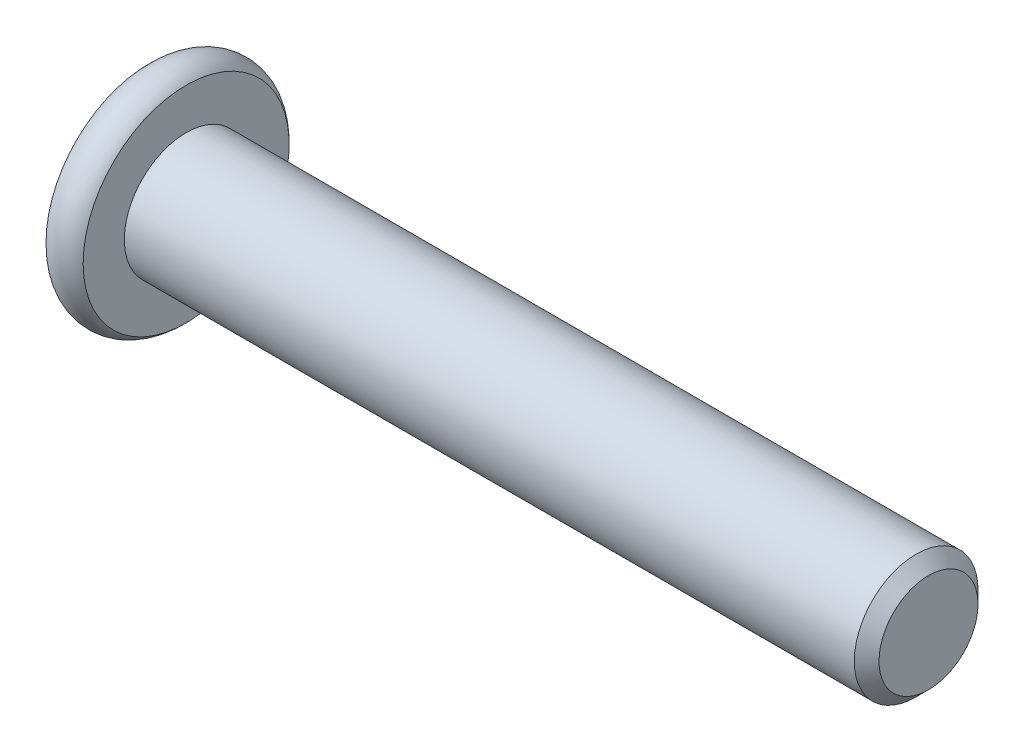
ISO-10303-21;
HEADER;
FILE_DESCRIPTION(('STEP AP214'),'2;1');
FILE_NAME('part.step','',(''),(''),'','','');
FILE_SCHEMA(('AUTOMOTIVE_DESIGN { 1 0 10303 214 1 1 1 1 }'));
ENDSEC;
DATA;
#1=APPLICATION_CONTEXT('core data for automotive mechanical design processes');
#2=APPLICATION_PROTOCOL_DEFINITION('international standard','automotive_design',2000,#1);
#3=PRODUCT_CONTEXT('',#1,'mechanical');
#4=PRODUCT('Part','Part','',(#3));
#5=PRODUCT_RELATED_PRODUCT_CATEGORY('part','',(#4));
#6=PRODUCT_DEFINITION_FORMATION('','',#4);
#7=PRODUCT_DEFINITION_CONTEXT('part definition',#1,'design');
#8=PRODUCT_DEFINITION('design','',#6,#7);
#9=PRODUCT_DEFINITION_SHAPE('','',#8);
#10=(LENGTH_UNIT() NAMED_UNIT(*) SI_UNIT(.MILLI.,.METRE.));
#11=(NAMED_UNIT(*) PLANE_ANGLE_UNIT() SI_UNIT($,.RADIAN.));
#12=(NAMED_UNIT(*) SI_UNIT($,.STERADIAN.) SOLID_ANGLE_UNIT());
#13=UNCERTAINTY_MEASURE_WITH_UNIT(LENGTH_MEASURE(1.E-05),#10,'distance_accuracy_value','');
#14=(GEOMETRIC_REPRESENTATION_CONTEXT(3) GLOBAL_UNCERTAINTY_ASSIGNED_CONTEXT((#13)) GLOBAL_UNIT_ASSIGNED_CONTEXT((#10,
#11,#12)) REPRESENTATION_CONTEXT('',''));
#15=CARTESIAN_POINT('',(0.,0.,0.));
#16=DIRECTION('',(0.,0.,1.));
#17=DIRECTION('',(1.,0.,0.));
#18=AXIS2_PLACEMENT_3D('',#15,#16,#17);
#19=CARTESIAN_POINT('',(-29.2,4.9960036108132E-13,-1.66533453693773E-13));
#20=DIRECTION('',(-1.,0.,0.));
#21=DIRECTION('',(0.,-1.,0.));
#22=AXIS2_PLACEMENT_3D('',#19,#20,#21);
#23=PLANE('',#22);
#24=DIRECTION('',(0.,-0.5,-0.866025403784439));
#25=VECTOR('',#24,1.);
#26=CARTESIAN_POINT('',(-29.1999999999998,-1.73205080756833,-1.11022302462516E-13));
#27=LINE('',#26,#25);
#28=CARTESIAN_POINT('',(-29.1999999999998,-1.73205080756837,-1.36681350815989E-13));
#29=VERTEX_POINT('',#28);
#30=CARTESIAN_POINT('',(-29.1999999999999,-0.866025403783914,1.49999999999998));
#31=VERTEX_POINT('',#30);
#32=EDGE_CURVE('E104',#29,#31,#27,.F.);
#33=ORIENTED_EDGE('',*,*,#32,.T.);
#34=DIRECTION('',(0.,1.,0.));
#35=VECTOR('',#34,1.);
#36=CARTESIAN_POINT('',(-29.2,-0.866025403784165,1.5));
#37=LINE('',#36,#35);
#38=CARTESIAN_POINT('',(-29.2,0.866025403784831,1.50000000000004));
#39=VERTEX_POINT('',#38);
#40=EDGE_CURVE('E120',#31,#39,#37,.T.);
#41=ORIENTED_EDGE('',*,*,#40,.T.);
#42=DIRECTION('',(0.,-0.5,0.866025403784439));
#43=VECTOR('',#42,1.);
#44=CARTESIAN_POINT('',(-29.2,0.866025403784831,1.50000000000006));
#45=LINE('',#44,#43);
#46=CARTESIAN_POINT('',(-29.2,1.73205080756935,-1.2616671602424E-13));
#47=VERTEX_POINT('',#46);
#48=EDGE_CURVE('E72',#39,#47,#45,.F.);
#49=ORIENTED_EDGE('',*,*,#48,.T.);
#50=DIRECTION('',(0.,0.5,0.866025403784439));
#51=VECTOR('',#50,1.);
#52=CARTESIAN_POINT('',(-29.2,1.73205080756916,-2.77555756156289E-13));
#53=LINE('',#52,#51);
#54=CARTESIAN_POINT('',(-29.2,0.866025403784858,-1.50000000000003));
#55=VERTEX_POINT('',#54);
#56=EDGE_CURVE('E86',#47,#55,#53,.F.);
#57=ORIENTED_EDGE('',*,*,#56,.T.);
#58=DIRECTION('',(0.,1.,0.));
#59=VECTOR('',#58,1.);
#60=CARTESIAN_POINT('',(-29.1999999999999,0.866025403784776,-1.5));
#61=LINE('',#60,#59);
#62=CARTESIAN_POINT('',(-29.1999999999998,-0.866025403784165,-1.49999999999996));
#63=VERTEX_POINT('',#62);
#64=EDGE_CURVE('E88',#55,#63,#61,.F.);
#65=ORIENTED_EDGE('',*,*,#64,.T.);
#66=DIRECTION('',(0.,0.5,-0.866025403784439));
#67=VECTOR('',#66,1.);
#68=CARTESIAN_POINT('',(-29.1999999999998,-0.866025403784165,-1.49999999999995));
#69=LINE('',#68,#67);
#70=EDGE_CURVE('E97',#63,#29,#69,.F.);
#71=ORIENTED_EDGE('',*,*,#70,.T.);
#72=EDGE_LOOP('',(#33,#41,#49,#57,#65,#71));
#73=FACE_BOUND('',#72,.T.);
#74=ADVANCED_FACE('F16',(#73),#23,.T.);
#75=CARTESIAN_POINT('',(-29.1999999999999,0.866025403784776,-1.5));
#76=DIRECTION('',(0.,0.,-1.));
#77=DIRECTION('',(-1.,0.,0.));
#78=AXIS2_PLACEMENT_3D('',#75,#76,#77);
#79=PLANE('',#78);
#80=CARTESIAN_POINT('',(-31.4499999646141,0.866025333109033,-1.5000000000085));
#81=CARTESIAN_POINT('',(-31.4202628181005,0.806493905015061,-1.50000000000306));
#82=CARTESIAN_POINT('',(-31.3922724727218,0.745967110571508,-1.50000000000082));
#83=CARTESIAN_POINT('',(-31.341023345539,0.622546765553089,-1.49999999999918));
#84=CARTESIAN_POINT('',(-31.3177930694095,0.559641484114204,-1.49999999999978));
#85=CARTESIAN_POINT('',(-31.2779994504319,0.432796069089136,-1.50000000000022));
#86=CARTESIAN_POINT('',(-31.2613361148305,0.368888221793658,-1.50000000000006));
#87=CARTESIAN_POINT('',(-31.2356630720953,0.239665989410866,-1.49999999999995));
#88=CARTESIAN_POINT('',(-31.2266342081959,0.174355549031414,-1.49999999999999));
#89=CARTESIAN_POINT('',(-31.2184874101039,0.0617869427984574,-1.50000000000001));
#90=CARTESIAN_POINT('',(-31.2172818822941,0.0146740817531845,-1.50000000000001));
#91=CARTESIAN_POINT('',(-31.2193161387584,-0.079468418716285,-1.5));
#92=CARTESIAN_POINT('',(-31.2225569049897,-0.126498037459534,-1.5));
#93=CARTESIAN_POINT('',(-31.2332973068424,-0.220104333455266,-1.5));
#94=CARTESIAN_POINT('',(-31.2408009027321,-0.266680548501092,-1.5));
#95=CARTESIAN_POINT('',(-31.2596594759155,-0.359051196493831,-1.5));
#96=CARTESIAN_POINT('',(-31.2710161058228,-0.404845285109846,-1.5));
#97=CARTESIAN_POINT('',(-31.3047185803687,-0.522097693777987,-1.5));
#98=CARTESIAN_POINT('',(-31.3296009770508,-0.592830027017352,-1.5));
#99=CARTESIAN_POINT('',(-31.3716037139491,-0.696834151559703,-1.5));
#100=CARTESIAN_POINT('',(-31.3863606344863,-0.731106739462387,-1.5));
#101=CARTESIAN_POINT('',(-31.4172215006372,-0.799021963488364,-1.5));
#102=CARTESIAN_POINT('',(-31.4333248052964,-0.832664890135085,-1.5));
#103=CARTESIAN_POINT('',(-31.4499999646169,-0.866025333104326,-1.5));
#104=B_SPLINE_CURVE_WITH_KNOTS('',3,(#80,#81,#82,#83,#84,#85,#86,#87,#88,#89,#90,#91,#92,#93,
#94,#95,#96,#97,#98,#99,#100,#101,#102,#103),.UNSPECIFIED.,.F.,.F.,(4,2,2,2,2,2,2,2,2,2,2,4),
(0.,0.199774403128051,0.400712278338178,0.598459940128664,0.795709919390831,0.936894623860907,
1.07811051377203,1.21945781158344,1.36086581179142,1.58533898629328,1.69726351151979,
1.80913505448519),.UNSPECIFIED.);
#105=CARTESIAN_POINT('',(-31.4500000035035,0.866025400238091,-1.50000000614324));
#106=VERTEX_POINT('',#105);
#107=CARTESIAN_POINT('',(-31.4499999822866,-0.866025368443855,-1.49999999999997));
#108=VERTEX_POINT('',#107);
#109=EDGE_CURVE('E19',#106,#108,#104,.T.);
#110=ORIENTED_EDGE('',*,*,#109,.T.);
#111=DIRECTION('',(1.,0.,0.));
#112=VECTOR('',#111,1.);
#113=CARTESIAN_POINT('',(-29.1999999999998,-0.866025403784165,-1.49999999999995));
#114=LINE('',#113,#112);
#115=EDGE_CURVE('E91',#108,#63,#114,.T.);
#116=ORIENTED_EDGE('',*,*,#115,.T.);
#117=ORIENTED_EDGE('',*,*,#64,.F.);
#118=DIRECTION('',(1.,0.,0.));
#119=VECTOR('',#118,1.);
#120=CARTESIAN_POINT('',(-29.2,0.866025403784858,-1.50000000000005));
#121=LINE('',#120,#119);
#122=EDGE_CURVE('E62',#55,#106,#121,.F.);
#123=ORIENTED_EDGE('',*,*,#122,.T.);
#124=EDGE_LOOP('',(#110,#116,#117,#123));
#125=FACE_BOUND('',#124,.T.);
#126=ADVANCED_FACE('F93',(#125),#79,.F.);
#127=CARTESIAN_POINT('',(-29.1999999999998,-0.866025403784165,-1.49999999999995));
#128=DIRECTION('',(0.,-0.866025403784439,-0.5));
#129=DIRECTION('',(0.,0.5,-0.866025403784439));
#130=AXIS2_PLACEMENT_3D('',#127,#128,#129);
#131=PLANE('',#130);
#132=CARTESIAN_POINT('',(-31.4500000070517,-0.866025396689224,-1.50000001228873));
#133=CARTESIAN_POINT('',(-31.4202628558186,-0.895791113287211,-1.44844427881732));
#134=CARTESIAN_POINT('',(-31.3922725057992,-0.92605451312871,-1.39602653268208));
#135=CARTESIAN_POINT('',(-31.3410233697625,-0.987764691129871,-1.28914136903995));
#136=CARTESIAN_POINT('',(-31.317793089431,-1.01921733472431,-1.23466379230201));
#137=CARTESIAN_POINT('',(-31.2779994630445,-1.08264004807433,-1.12481243042591));
#138=CARTESIAN_POINT('',(-31.2613361242021,-1.11459397467748,-1.06946660604793));
#139=CARTESIAN_POINT('',(-31.2356630762838,-1.17920509696995,-0.957556859503323));
#140=CARTESIAN_POINT('',(-31.2266342104335,-1.21186032030421,-0.900996353555884));
#141=CARTESIAN_POINT('',(-31.2184874107184,-1.26814462672892,-0.803509075159503));
#142=CARTESIAN_POINT('',(-31.2172818824303,-1.29170105737759,-0.762708140431041));
#143=CARTESIAN_POINT('',(-31.2193161379934,-1.33877230788476,-0.68117834297682));
#144=CARTESIAN_POINT('',(-31.2225569038014,-1.3622871174028,-0.640449498161273));
#145=CARTESIAN_POINT('',(-31.2332973048878,-1.40909026571364,-0.559384067332716));
#146=CARTESIAN_POINT('',(-31.2408009004353,-1.43237837340307,-0.519047881602485));
#147=CARTESIAN_POINT('',(-31.259659473023,-1.47856369773901,-0.439052553288588));
#148=CARTESIAN_POINT('',(-31.271016102677,-1.50146074222005,-0.399393708904251));
#149=CARTESIAN_POINT('',(-31.3047185807569,-1.5600869540961,-0.297850131279648));
#150=CARTESIAN_POINT('',(-31.3296009829507,-1.59545312784853,-0.236594121471116));
#151=CARTESIAN_POINT('',(-31.371603729808,-1.64745520041146,-0.146523889693241));
#152=CARTESIAN_POINT('',(-31.3863606539476,-1.66459149772793,-0.116842952087518));
#153=CARTESIAN_POINT('',(-31.4172215277412,-1.69854911634305,-0.0580266313420838));
#154=CARTESIAN_POINT('',(-31.4333248364396,-1.71537058290364,-0.0288909966013243));
#155=CARTESIAN_POINT('',(-31.4499999999651,-1.73205080757667,1.40423601078216E-11));
#156=B_SPLINE_CURVE_WITH_KNOTS('',3,(#132,#133,#134,#135,#136,#137,#138,#139,#140,#141,#142,
#143,#144,#145,#146,#147,#148,#149,#150,#151,#152,#153,#154,#155),.UNSPECIFIED.,.F.,.F.,(4,2,2,
2,2,2,2,2,2,2,2,4),(0.,0.199774423192106,0.400712318917054,0.598460000239517,0.795709998838408,
0.936894704101157,1.07811059479583,1.21945789342344,1.36086589445371,1.58533911452316,
1.69726366256187,1.80913522826942),.UNSPECIFIED.);
#157=CARTESIAN_POINT('',(-31.4499999999782,-1.73205080757729,-1.53843792289612E-13));
#158=VERTEX_POINT('',#157);
#159=EDGE_CURVE('E191',#108,#158,#156,.T.);
#160=ORIENTED_EDGE('',*,*,#159,.T.);
#161=DIRECTION('',(1.,0.,0.));
#162=VECTOR('',#161,1.);
#163=CARTESIAN_POINT('',(-29.1999999999998,-1.73205080756833,-1.11021512789993E-13));
#164=LINE('',#163,#162);
#165=EDGE_CURVE('E108',#158,#29,#164,.T.);
#166=ORIENTED_EDGE('',*,*,#165,.T.);
#167=ORIENTED_EDGE('',*,*,#70,.F.);
#168=ORIENTED_EDGE('',*,*,#115,.F.);
#169=EDGE_LOOP('',(#160,#166,#167,#168));
#170=FACE_BOUND('',#169,.T.);
#171=ADVANCED_FACE('F197',(#170),#131,.F.);
#172=CARTESIAN_POINT('',(-29.2,1.73205080756916,-2.77555756156289E-13));
#173=DIRECTION('',(0.,0.866025403784439,-0.5));
#174=DIRECTION('',(0.,0.5,0.866025403784439));
#175=AXIS2_PLACEMENT_3D('',#172,#173,#174);
#176=PLANE('',#175);
#177=CARTESIAN_POINT('',(-31.4499999999725,1.73205080756821,2.18049156484357E-11));
#178=CARTESIAN_POINT('',(-31.4202628495127,1.70228509139278,-0.0515557327329282));
#179=CARTESIAN_POINT('',(-31.3922725002569,1.67202169198049,-0.103973478131008));
#180=CARTESIAN_POINT('',(-31.3410233656822,1.61031151487536,-0.210858640225767));
#181=CARTESIAN_POINT('',(-31.3177930860473,1.57885887174818,-0.265336216152685));
#182=CARTESIAN_POINT('',(-31.2779994609075,1.51543615937137,-0.375187576341918));
#183=CARTESIAN_POINT('',(-31.2613361226165,1.48348223327373,-0.430533399844778));
#184=CARTESIAN_POINT('',(-31.2356630755785,1.41887111202438,-0.542443144582976));
#185=CARTESIAN_POINT('',(-31.2266342100587,1.38621588922753,-0.599003649599462));
#186=CARTESIAN_POINT('',(-31.2184874106166,1.32993158337211,-0.696490927009743));
#187=CARTESIAN_POINT('',(-31.2172818824079,1.30637515274893,-0.737291861694081));
#188=CARTESIAN_POINT('',(-31.219316138119,1.25930390229614,-0.818821659054129));
#189=CARTESIAN_POINT('',(-31.2225569039956,1.23578909280699,-0.859550503819626));
#190=CARTESIAN_POINT('',(-31.2332973052062,1.18898594454853,-0.940615934557461));
#191=CARTESIAN_POINT('',(-31.2408009008108,1.16569783688266,-0.980952120246873));
#192=CARTESIAN_POINT('',(-31.2596594734994,1.11951251259497,-1.06094744847721));
#193=CARTESIAN_POINT('',(-31.2710161031972,1.0966154681386,-1.10060629281881));
#194=CARTESIAN_POINT('',(-31.3047185820306,1.03798925518337,-1.20214987231262));
#195=CARTESIAN_POINT('',(-31.3296009851918,1.00262308036507,-1.26340588396728));
#196=CARTESIAN_POINT('',(-31.3716037337272,0.950621006271713,-1.35347611839593));
#197=CARTESIAN_POINT('',(-31.3863606584605,0.933484708459596,-1.38315705686015));
#198=CARTESIAN_POINT('',(-31.4172215335001,0.899527088871887,-1.44197337929016));
#199=CARTESIAN_POINT('',(-31.4333248428507,0.882705621834331,-1.47110901485705));
#200=CARTESIAN_POINT('',(-31.4500000070502,0.866025396691318,-1.50000001228643));
#201=B_SPLINE_CURVE_WITH_KNOTS('',3,(#177,#178,#179,#180,#181,#182,#183,#184,#185,#186,#187,
#188,#189,#190,#191,#192,#193,#194,#195,#196,#197,#198,#199,#200),.UNSPECIFIED.,.F.,.F.,(4,2,2,
2,2,2,2,2,2,2,2,4),(0.,0.199774419915111,0.400712312287351,0.598459990272512,0.795709985567516,
0.936894690671439,1.07811058120841,1.21945787972443,1.36086588064393,1.5853391076686,
1.69726365914246,1.80913522827493),.UNSPECIFIED.);
#202=CARTESIAN_POINT('',(-31.4499999999862,1.73205080755837,9.02567581641119E-12));
#203=VERTEX_POINT('',#202);
#204=EDGE_CURVE('E101',#203,#106,#201,.T.);
#205=ORIENTED_EDGE('',*,*,#204,.T.);
#206=ORIENTED_EDGE('',*,*,#122,.F.);
#207=ORIENTED_EDGE('',*,*,#56,.F.);
#208=DIRECTION('',(1.,0.,0.));
#209=VECTOR('',#208,1.);
#210=CARTESIAN_POINT('',(-29.2,1.73205080756939,-1.4810201676152E-13));
#211=LINE('',#210,#209);
#212=EDGE_CURVE('E43',#47,#203,#211,.F.);
#213=ORIENTED_EDGE('',*,*,#212,.T.);
#214=EDGE_LOOP('',(#205,#206,#207,#213));
#215=FACE_BOUND('',#214,.T.);
#216=ADVANCED_FACE('F99',(#215),#176,.F.);
#217=CARTESIAN_POINT('',(-29.1999999999998,-1.73205080756833,-1.11022302462516E-13));
#218=DIRECTION('',(0.,-0.866025403784439,0.5));
#219=DIRECTION('',(0.,-0.5,-0.866025403784439));
#220=AXIS2_PLACEMENT_3D('',#217,#218,#219);
#221=PLANE('',#220);
#222=CARTESIAN_POINT('',(-31.4499999999691,-1.73205080756877,-1.76284288946235E-11));
#223=CARTESIAN_POINT('',(-31.4202628495464,-1.70228509142721,0.0515557326739406));
#224=CARTESIAN_POINT('',(-31.3922725003231,-1.67202169205149,0.103973478006846));
#225=CARTESIAN_POINT('',(-31.3410233657993,-1.61031151502301,0.210858639967479));
#226=CARTESIAN_POINT('',(-31.3177930861826,-1.57885887193593,0.265336215825441));
#227=CARTESIAN_POINT('',(-31.2779994610125,-1.51543615956396,0.375187576006662));
#228=CARTESIAN_POINT('',(-31.2613361226879,-1.48348223342861,0.430533399574712));
#229=CARTESIAN_POINT('',(-31.2356630756004,-1.41887111210186,0.542443144446861));
#230=CARTESIAN_POINT('',(-31.2266342100644,-1.38621588926535,0.599003649532088));
#231=CARTESIAN_POINT('',(-31.2184874106146,-1.32993158335581,0.696490927036125));
#232=CARTESIAN_POINT('',(-31.2172818824065,-1.30637515271844,0.737291861745034));
#233=CARTESIAN_POINT('',(-31.2193161381243,-1.25930390223719,0.818821659154365));
#234=CARTESIAN_POINT('',(-31.222556904007,-1.23578909273378,0.859550503944573));
#235=CARTESIAN_POINT('',(-31.2332973052281,-1.18898594447538,0.940615934682302));
#236=CARTESIAN_POINT('',(-31.240800900832,-1.16569783682355,0.98095212034741));
#237=CARTESIAN_POINT('',(-31.2596594735144,-1.11951251256383,1.06094744852929));
#238=CARTESIAN_POINT('',(-31.2710161032065,-1.09661546812139,1.10060629284676));
#239=CARTESIAN_POINT('',(-31.3047185776502,-1.03798926280283,1.20214985911346));
#240=CARTESIAN_POINT('',(-31.3296009746461,-1.0026230953544,1.26340585800314));
#241=CARTESIAN_POINT('',(-31.3716037122698,-0.950621031870462,1.35347607405574));
#242=CARTESIAN_POINT('',(-31.3863606330995,-0.933484737511827,1.38315700653835));
#243=CARTESIAN_POINT('',(-31.4172214999019,-0.899527124700108,1.441973317232));
#244=CARTESIAN_POINT('',(-31.4333248049199,-0.882705660985281,1.47110894704375));
#245=CARTESIAN_POINT('',(-31.4499999646252,-0.866025439115546,1.49999993880366));
#246=B_SPLINE_CURVE_WITH_KNOTS('',3,(#222,#223,#224,#225,#226,#227,#228,#229,#230,#231,#232,
#233,#234,#235,#236,#237,#238,#239,#240,#241,#242,#243,#244,#245),.UNSPECIFIED.,.F.,.F.,(4,2,2,
2,2,2,2,2,2,2,2,4),(0.,0.199774419672155,0.400712311802041,0.598459990029991,0.795709985565508,
0.936894690754185,1.07811058137718,1.21945787981101,1.36086588064235,1.58533906010695,
1.6972635879238,1.80913513347089),.UNSPECIFIED.);
#247=CARTESIAN_POINT('',(-31.449999982291,-0.866025421449815,1.49999996940171));
#248=VERTEX_POINT('',#247);
#249=EDGE_CURVE('E265',#158,#248,#246,.T.);
#250=ORIENTED_EDGE('',*,*,#249,.T.);
#251=DIRECTION('',(1.,0.,0.));
#252=VECTOR('',#251,1.);
#253=CARTESIAN_POINT('',(-29.2,-0.866025403783943,1.5));
#254=LINE('',#253,#252);
#255=EDGE_CURVE('E123',#248,#31,#254,.T.);
#256=ORIENTED_EDGE('',*,*,#255,.T.);
#257=ORIENTED_EDGE('',*,*,#32,.F.);
#258=ORIENTED_EDGE('',*,*,#165,.F.);
#259=EDGE_LOOP('',(#250,#256,#257,#258));
#260=FACE_BOUND('',#259,.T.);
#261=ADVANCED_FACE('F258',(#260),#221,.F.);
#262=CARTESIAN_POINT('',(-29.2,-0.866025403784165,1.5));
#263=DIRECTION('',(0.,0.,1.));
#264=DIRECTION('',(1.,0.,0.));
#265=AXIS2_PLACEMENT_3D('',#262,#263,#264);
#266=PLANE('',#265);
#267=CARTESIAN_POINT('',(-31.4500000070434,-0.866025417956765,1.5));
#268=CARTESIAN_POINT('',(-31.4202628558412,-0.806493984821788,1.5));
#269=CARTESIAN_POINT('',(-31.3922725058493,-0.745967185202155,1.5));
#270=CARTESIAN_POINT('',(-31.3410233698562,-0.622546829330663,1.5));
#271=CARTESIAN_POINT('',(-31.3177930895408,-0.559641542209251,1.5));
#272=CARTESIAN_POINT('',(-31.2779994631302,-0.432796115519122,1.5));
#273=CARTESIAN_POINT('',(-31.2613361242605,-0.368888262251169,1.5));
#274=CARTESIAN_POINT('',(-31.2356630763016,-0.239666017539557,1.5));
#275=CARTESIAN_POINT('',(-31.226634210438,-0.174355570806053,1.5));
#276=CARTESIAN_POINT('',(-31.2184874107167,-0.0617869578676496,1.5));
#277=CARTESIAN_POINT('',(-31.2172818824291,-0.0146740965467559,1.5));
#278=CARTESIAN_POINT('',(-31.2193161379979,0.0794684045148393,1.5));
#279=CARTESIAN_POINT('',(-31.222556903811,0.126498023574608,1.5));
#280=CARTESIAN_POINT('',(-31.2332973049061,0.220104320196022,1.5));
#281=CARTESIAN_POINT('',(-31.2408009004531,0.266680535551418,1.5));
#282=CARTESIAN_POINT('',(-31.2596594730356,0.359051184176512,1.5));
#283=CARTESIAN_POINT('',(-31.2710161026848,0.404845273115313,1.5));
#284=CARTESIAN_POINT('',(-31.3047185771059,0.522097684137572,1.5));
#285=CARTESIAN_POINT('',(-31.3296009741613,0.592830019357443,1.5));
#286=CARTESIAN_POINT('',(-31.3716037119241,0.6968341467982,1.5));
#287=CARTESIAN_POINT('',(-31.3863606328101,0.731106735674428,1.5));
#288=CARTESIAN_POINT('',(-31.4172214997383,0.799021961609588,1.5));
#289=CARTESIAN_POINT('',(-31.4333248048256,0.832664889192015,1.5));
#290=CARTESIAN_POINT('',(-31.4499999646054,0.866025333081774,1.5));
#291=B_SPLINE_CURVE_WITH_KNOTS('',3,(#267,#268,#269,#270,#271,#272,#273,#274,#275,#276,#277,
#278,#279,#280,#281,#282,#283,#284,#285,#286,#287,#288,#289,#290),.UNSPECIFIED.,.F.,.F.,(4,2,2,
2,2,2,2,2,2,2,2,4),(0.,0.199774422986118,0.400712318505439,0.598460000026677,0.795709998822506,
0.936894704155634,1.07811059492174,1.21945789348061,1.36086589443719,1.58533907486713,
1.69726360318859,1.80913514923859),.UNSPECIFIED.);
#292=CARTESIAN_POINT('',(-31.4499999822812,0.866025368433428,1.50000000000003));
#293=VERTEX_POINT('',#292);
#294=EDGE_CURVE('E166',#248,#293,#291,.T.);
#295=ORIENTED_EDGE('',*,*,#294,.T.);
#296=DIRECTION('',(1.,0.,0.));
#297=VECTOR('',#296,1.);
#298=CARTESIAN_POINT('',(-29.2,0.866025403784831,1.50000000000006));
#299=LINE('',#298,#297);
#300=EDGE_CURVE('E235',#293,#39,#299,.T.);
#301=ORIENTED_EDGE('',*,*,#300,.T.);
#302=ORIENTED_EDGE('',*,*,#40,.F.);
#303=ORIENTED_EDGE('',*,*,#255,.F.);
#304=EDGE_LOOP('',(#295,#301,#302,#303));
#305=FACE_BOUND('',#304,.T.);
#306=ADVANCED_FACE('F269',(#305),#266,.F.);
#307=CARTESIAN_POINT('',(-29.2,0.866025403784831,1.50000000000006));
#308=DIRECTION('',(0.,0.866025403784439,0.5));
#309=DIRECTION('',(0.,-0.5,0.866025403784439));
#310=AXIS2_PLACEMENT_3D('',#307,#308,#309);
#311=PLANE('',#310);
#312=CARTESIAN_POINT('',(-31.4500000070402,0.866025396701591,1.5000000122686));
#313=CARTESIAN_POINT('',(-31.4202628558084,0.895791113298902,1.44844427879836));
#314=CARTESIAN_POINT('',(-31.3922725057902,0.926054513139705,1.39602653266432));
#315=CARTESIAN_POINT('',(-31.3410233697559,0.987764691139409,1.28914136902471));
#316=CARTESIAN_POINT('',(-31.3177930894255,1.01921733473309,1.2346637922881));
#317=CARTESIAN_POINT('',(-31.277999463041,1.08264004808154,1.12481243041471));
#318=CARTESIAN_POINT('',(-31.2613361241995,1.11459397468388,1.06946660603813));
#319=CARTESIAN_POINT('',(-31.2356630762826,1.17920509697469,0.9575568594964));
#320=CARTESIAN_POINT('',(-31.2266342104328,1.21186032030809,0.900996353550444));
#321=CARTESIAN_POINT('',(-31.2184874107182,1.2681446267319,0.80350907515563));
#322=CARTESIAN_POINT('',(-31.2172818824302,1.29170105738053,0.762708140427234));
#323=CARTESIAN_POINT('',(-31.2193161379935,1.33877230788761,0.681178342973155));
#324=CARTESIAN_POINT('',(-31.2225569038017,1.36228711740561,0.640449498157685));
#325=CARTESIAN_POINT('',(-31.2332973048882,1.40909026571636,0.559384067329276));
#326=CARTESIAN_POINT('',(-31.2408009004359,1.43237837340575,0.519047881599118));
#327=CARTESIAN_POINT('',(-31.2596594730237,1.47856369774161,0.43905255328537));
#328=CARTESIAN_POINT('',(-31.2710161026778,1.50146074222261,0.399393708901107));
#329=CARTESIAN_POINT('',(-31.3047185807579,1.56008695409864,0.297850131276529));
#330=CARTESIAN_POINT('',(-31.3296009829519,1.5954531278511,0.236594121467952));
#331=CARTESIAN_POINT('',(-31.3716037298094,1.64745520041406,0.146523889690023));
#332=CARTESIAN_POINT('',(-31.386360653949,1.66459149773053,0.11684295208429));
#333=CARTESIAN_POINT('',(-31.4172215277427,1.69854911634567,0.0580266313388344));
#334=CARTESIAN_POINT('',(-31.4333248364411,1.71537058290626,0.0288909965980637));
#335=CARTESIAN_POINT('',(-31.4499999999668,1.73205080757931,-1.73147332039655E-11));
#336=B_SPLINE_CURVE_WITH_KNOTS('',3,(#312,#313,#314,#315,#316,#317,#318,#319,#320,#321,#322,
#323,#324,#325,#326,#327,#328,#329,#330,#331,#332,#333,#334,#335),.UNSPECIFIED.,.F.,.F.,(4,2,2,
2,2,2,2,2,2,2,2,4),(0.,0.199774423186773,0.400712318906267,0.598460000223412,0.795709998817039,
0.936894704079548,1.07811059477398,1.21945789340139,1.36086589443146,1.5853391145012,
1.69726366254002,1.80913522824768),.UNSPECIFIED.);
#337=EDGE_CURVE('E159',#293,#203,#336,.T.);
#338=ORIENTED_EDGE('',*,*,#337,.T.);
#339=ORIENTED_EDGE('',*,*,#212,.F.);
#340=ORIENTED_EDGE('',*,*,#48,.F.);
#341=ORIENTED_EDGE('',*,*,#300,.F.);
#342=EDGE_LOOP('',(#338,#339,#340,#341));
#343=FACE_BOUND('',#342,.T.);
#344=ADVANCED_FACE('F172',(#343),#311,.F.);
#345=CARTESIAN_POINT('',(-31.4999999999941,4.9960036108132E-13,-1.66533453693779E-13));
#346=DIRECTION('',(-1.,0.,0.));
#347=DIRECTION('',(0.,-1.,0.));
#348=AXIS2_PLACEMENT_3D('',#345,#346,#347);
#349=CONICAL_SURFACE('',#348,1.78205080760613,0.78539816339745);
#350=ORIENTED_EDGE('',*,*,#249,.F.);
#351=ORIENTED_EDGE('',*,*,#159,.F.);
#352=ORIENTED_EDGE('',*,*,#109,.F.);
#353=ORIENTED_EDGE('',*,*,#204,.F.);
#354=ORIENTED_EDGE('',*,*,#337,.F.);
#355=ORIENTED_EDGE('',*,*,#294,.F.);
#356=EDGE_LOOP('',(#350,#351,#352,#353,#354,#355));
#357=FACE_BOUND('',#356,.T.);
#358=CARTESIAN_POINT('',(-31.499999999823,4.99600361080654E-13,-1.66533453693779E-13));
#359=DIRECTION('',(-1.,0.,0.));
#360=DIRECTION('',(0.,-1.,0.));
#361=AXIS2_PLACEMENT_3D('',#358,#359,#360);
#362=CIRCLE('',#361,1.7820508074351);
#363=CARTESIAN_POINT('',(-31.4999999998231,-1.7820508074346,-1.66533453693779E-13));
#364=VERTEX_POINT('',#363);
#365=EDGE_CURVE('E155',#364,#364,#362,.T.);
#366=ORIENTED_EDGE('',*,*,#365,.T.);
#367=EDGE_LOOP('',(#366));
#368=FACE_BOUND('',#367,.T.);
#369=ADVANCED_FACE('F174',(#357,#368),#349,.F.);
#370=CARTESIAN_POINT('',(-31.5000000000001,2.77555756156289E-13,0.));
#371=DIRECTION('',(1.,0.,0.));
#372=DIRECTION('',(0.,0.,-1.));
#373=AXIS2_PLACEMENT_3D('',#370,#371,#372);
#374=PLANE('',#373);
#375=CARTESIAN_POINT('',(-31.5000000000001,2.77907273293885E-13,0.));
#376=DIRECTION('',(-1.,0.,0.));
#377=DIRECTION('',(0.,0.,1.));
#378=AXIS2_PLACEMENT_3D('',#375,#376,#377);
#379=CIRCLE('',#378,4.16143782776611);
#380=CARTESIAN_POINT('',(-31.5000000000001,2.77907273293885E-13,4.16143782776617));
#381=VERTEX_POINT('',#380);
#382=EDGE_CURVE('E151',#381,#381,#379,.F.);
#383=ORIENTED_EDGE('',*,*,#382,.F.);
#384=EDGE_LOOP('',(#383));
#385=FACE_BOUND('',#384,.T.);
#386=ORIENTED_EDGE('',*,*,#365,.F.);
#387=EDGE_LOOP('',(#386));
#388=FACE_BOUND('',#387,.T.);
#389=ADVANCED_FACE('F178',(#385,#388),#374,.F.);
#390=CARTESIAN_POINT('',(-30.7500000000001,2.77555756156289E-13,0.));
#391=DIRECTION('',(-1.,0.,0.));
#392=DIRECTION('',(0.,-1.,0.));
#393=AXIS2_PLACEMENT_3D('',#390,#391,#392);
#394=TOROIDAL_SURFACE('',#393,3.5,1.);
#395=ORIENTED_EDGE('',*,*,#382,.T.);
#396=EDGE_LOOP('',(#395));
#397=FACE_BOUND('',#396,.T.);
#398=CARTESIAN_POINT('',(-29.9999999999999,2.77204239018693E-13,0.));
#399=DIRECTION('',(-1.,0.,0.));
#400=DIRECTION('',(0.,0.,1.));
#401=AXIS2_PLACEMENT_3D('',#398,#399,#400);
#402=CIRCLE('',#401,4.16143782776598);
#403=CARTESIAN_POINT('',(-29.9999999999999,2.77204239018693E-13,4.16143782776603));
#404=VERTEX_POINT('',#403);
#405=EDGE_CURVE('E147',#404,#404,#402,.T.);
#406=ORIENTED_EDGE('',*,*,#405,.T.);
#407=EDGE_LOOP('',(#406));
#408=FACE_BOUND('',#407,.T.);
#409=ADVANCED_FACE('F228',(#397,#408),#394,.T.);
#410=CARTESIAN_POINT('',(0.,0.,0.));
#411=DIRECTION('',(1.,0.,0.));
#412=DIRECTION('',(0.,0.,-1.));
#413=AXIS2_PLACEMENT_3D('',#410,#411,#412);
#414=PLANE('',#413);
#415=CARTESIAN_POINT('',(1.1368510299814E-10,0.,0.));
#416=DIRECTION('',(-1.,0.,0.));
#417=DIRECTION('',(0.,0.,1.));
#418=AXIS2_PLACEMENT_3D('',#415,#416,#417);
#419=CIRCLE('',#418,1.99999999989586);
#420=CARTESIAN_POINT('',(1.13686881089703E-10,0.,1.99999999989586));
#421=VERTEX_POINT('',#420);
#422=EDGE_CURVE('E143',#421,#421,#419,.T.);
#423=ORIENTED_EDGE('',*,*,#422,.F.);
#424=EDGE_LOOP('',(#423));
#425=FACE_BOUND('',#424,.T.);
#426=ADVANCED_FACE('F225',(#425),#414,.T.);
#427=CARTESIAN_POINT('',(-29.9999999999999,4.16143782776651,0.));
#428=DIRECTION('',(-1.,0.,0.));
#429=DIRECTION('',(0.,0.,1.));
#430=AXIS2_PLACEMENT_3D('',#427,#428,#429);
#431=PLANE('',#430);
#432=ORIENTED_EDGE('',*,*,#405,.F.);
#433=EDGE_LOOP('',(#432));
#434=FACE_BOUND('',#433,.T.);
#435=CARTESIAN_POINT('',(-30.,2.77555756156289E-13,0.));
#436=DIRECTION('',(1.,0.,0.));
#437=DIRECTION('',(0.,0.,-1.));
#438=AXIS2_PLACEMENT_3D('',#435,#436,#437);
#439=CIRCLE('',#438,2.49999999999998);
#440=CARTESIAN_POINT('',(-30.,2.77555756156289E-13,-2.49999999999993));
#441=VERTEX_POINT('',#440);
#442=EDGE_CURVE('E30',#441,#441,#439,.T.);
#443=ORIENTED_EDGE('',*,*,#442,.F.);
#444=EDGE_LOOP('',(#443));
#445=FACE_BOUND('',#444,.T.);
#446=ADVANCED_FACE('F218',(#434,#445),#431,.F.);
#447=CARTESIAN_POINT('',(-0.499999999931335,0.,0.));
#448=DIRECTION('',(-1.,0.,0.));
#449=DIRECTION('',(0.,0.,1.));
#450=AXIS2_PLACEMENT_3D('',#447,#448,#449);
#451=CONICAL_SURFACE('',#450,2.49999999999773,0.785398163454291);
#452=CARTESIAN_POINT('',(-0.499999999999938,2.63494103629219E-13,0.));
#453=DIRECTION('',(1.,0.,0.));
#454=DIRECTION('',(0.,0.,-1.));
#455=AXIS2_PLACEMENT_3D('',#452,#453,#454);
#456=CIRCLE('',#455,2.49999999999998);
#457=CARTESIAN_POINT('',(-0.49999999999994,2.63494103629219E-13,-2.49999999999995));
#458=VERTEX_POINT('',#457);
#459=EDGE_CURVE('E11',#458,#458,#456,.F.);
#460=ORIENTED_EDGE('',*,*,#459,.F.);
#461=EDGE_LOOP('',(#460));
#462=FACE_BOUND('',#461,.T.);
#463=ORIENTED_EDGE('',*,*,#422,.T.);
#464=EDGE_LOOP('',(#463));
#465=FACE_BOUND('',#464,.T.);
#466=ADVANCED_FACE('F212',(#462,#465),#451,.T.);
#467=CARTESIAN_POINT('',(-30.,2.77555756156289E-13,0.));
#468=DIRECTION('',(1.,0.,0.));
#469=DIRECTION('',(0.,0.,-1.));
#470=AXIS2_PLACEMENT_3D('',#467,#468,#469);
#471=CYLINDRICAL_SURFACE('',#470,2.49999999999998);
#472=ORIENTED_EDGE('',*,*,#442,.T.);
#473=EDGE_LOOP('',(#472));
#474=FACE_BOUND('',#473,.T.);
#475=ORIENTED_EDGE('',*,*,#459,.T.);
#476=EDGE_LOOP('',(#475));
#477=FACE_BOUND('',#476,.T.);
#478=ADVANCED_FACE('F210',(#474,#477),#471,.T.);
#479=CLOSED_SHELL('',(#74,#126,#171,#216,#261,#306,#344,#369,#389,#409,#426,#446,#466,#478));
#480=MANIFOLD_SOLID_BREP('B1',#479);
#481=ADVANCED_BREP_SHAPE_REPRESENTATION('',(#18,#480),#14);
#482=SHAPE_DEFINITION_REPRESENTATION(#9,#481);
ENDSEC;
END-ISO-10303-21;
